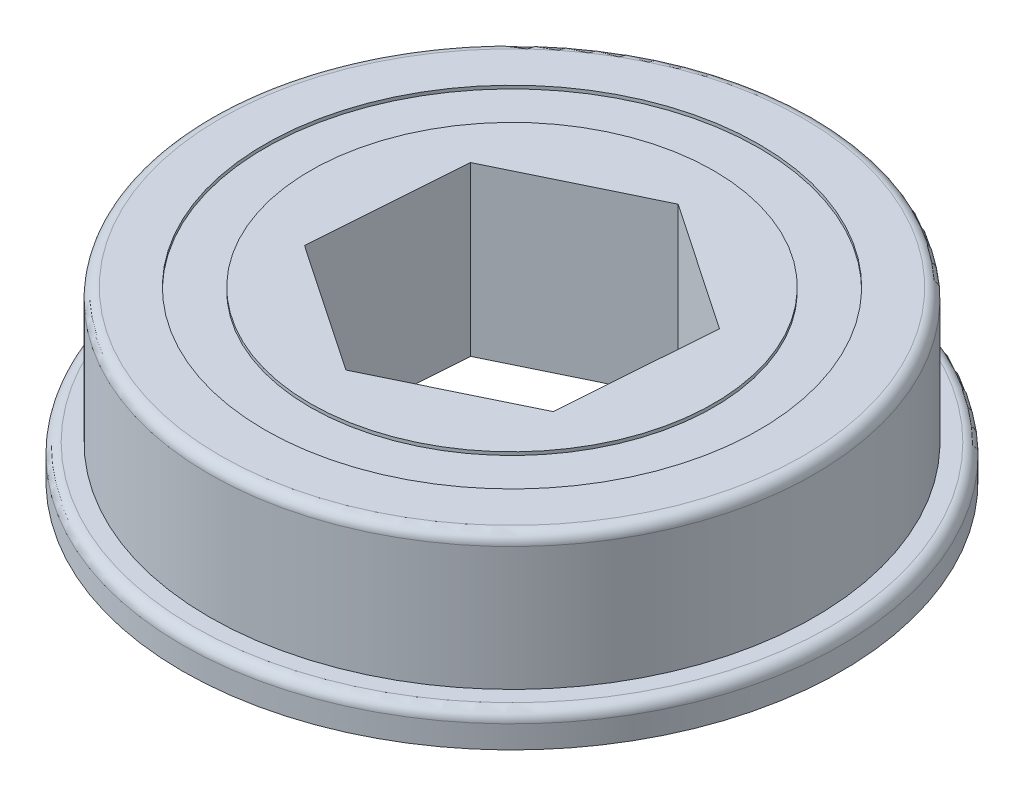
ISO-10303-21;
HEADER;
FILE_DESCRIPTION(('STEP AP214'),'2;1');
FILE_NAME('part.step','',(''),(''),'','','');
FILE_SCHEMA(('AUTOMOTIVE_DESIGN { 1 0 10303 214 1 1 1 1 }'));
ENDSEC;
DATA;
#1=APPLICATION_CONTEXT('core data for automotive mechanical design processes');
#2=APPLICATION_PROTOCOL_DEFINITION('international standard','automotive_design',2000,#1);
#3=PRODUCT_CONTEXT('',#1,'mechanical');
#4=PRODUCT('Part','Part','',(#3));
#5=PRODUCT_RELATED_PRODUCT_CATEGORY('part','',(#4));
#6=PRODUCT_DEFINITION_FORMATION('','',#4);
#7=PRODUCT_DEFINITION_CONTEXT('part definition',#1,'design');
#8=PRODUCT_DEFINITION('design','',#6,#7);
#9=PRODUCT_DEFINITION_SHAPE('','',#8);
#10=(LENGTH_UNIT() NAMED_UNIT(*) SI_UNIT(.MILLI.,.METRE.));
#11=(NAMED_UNIT(*) PLANE_ANGLE_UNIT() SI_UNIT($,.RADIAN.));
#12=(NAMED_UNIT(*) SI_UNIT($,.STERADIAN.) SOLID_ANGLE_UNIT());
#13=UNCERTAINTY_MEASURE_WITH_UNIT(LENGTH_MEASURE(1.E-05),#10,'distance_accuracy_value','');
#14=(GEOMETRIC_REPRESENTATION_CONTEXT(3) GLOBAL_UNCERTAINTY_ASSIGNED_CONTEXT((#13)) GLOBAL_UNIT_ASSIGNED_CONTEXT((#10,
#11,#12)) REPRESENTATION_CONTEXT('',''));
#15=CARTESIAN_POINT('',(0.,0.,0.));
#16=DIRECTION('',(0.,0.,1.));
#17=DIRECTION('',(1.,0.,0.));
#18=AXIS2_PLACEMENT_3D('',#15,#16,#17);
#19=CARTESIAN_POINT('',(0.,7.9248,0.));
#20=DIRECTION('',(0.,-1.,0.));
#21=DIRECTION('',(0.,0.,-1.));
#22=AXIS2_PLACEMENT_3D('',#19,#20,#21);
#23=CYLINDRICAL_SURFACE('',#22,9.525);
#24=CARTESIAN_POINT('',(0.,0.,0.));
#25=DIRECTION('',(0.,1.,0.));
#26=DIRECTION('',(0.,0.,1.));
#27=AXIS2_PLACEMENT_3D('',#24,#25,#26);
#28=CIRCLE('',#27,9.525);
#29=CARTESIAN_POINT('',(0.,0.,9.525));
#30=VERTEX_POINT('',#29);
#31=EDGE_CURVE('E124',#30,#30,#28,.T.);
#32=ORIENTED_EDGE('',*,*,#31,.T.);
#33=EDGE_LOOP('',(#32));
#34=FACE_BOUND('',#33,.T.);
#35=CARTESIAN_POINT('',(0.,0.1524,0.));
#36=DIRECTION('',(0.,1.,0.));
#37=DIRECTION('',(0.,0.,1.));
#38=AXIS2_PLACEMENT_3D('',#35,#36,#37);
#39=CIRCLE('',#38,9.525);
#40=CARTESIAN_POINT('',(0.,0.1524,9.525));
#41=VERTEX_POINT('',#40);
#42=EDGE_CURVE('E183',#41,#41,#39,.T.);
#43=ORIENTED_EDGE('',*,*,#42,.F.);
#44=EDGE_LOOP('',(#43));
#45=FACE_BOUND('',#44,.T.);
#46=ADVANCED_FACE('F40',(#34,#45),#23,.T.);
#47=CARTESIAN_POINT('',(0.,7.9248,0.));
#48=DIRECTION('',(0.,1.,0.));
#49=DIRECTION('',(0.,0.,1.));
#50=AXIS2_PLACEMENT_3D('',#47,#48,#49);
#51=PLANE('',#50);
#52=CARTESIAN_POINT('',(0.,7.9248,0.));
#53=DIRECTION('',(0.,1.,0.));
#54=DIRECTION('',(0.,0.,1.));
#55=AXIS2_PLACEMENT_3D('',#52,#53,#54);
#56=CIRCLE('',#55,9.525);
#57=CARTESIAN_POINT('',(0.,7.9248,9.525));
#58=VERTEX_POINT('',#57);
#59=EDGE_CURVE('E179',#58,#58,#56,.T.);
#60=ORIENTED_EDGE('',*,*,#59,.T.);
#61=EDGE_LOOP('',(#60));
#62=FACE_BOUND('',#61,.T.);
#63=DIRECTION('',(0.0721332531018952,0.,-0.997395003896118));
#64=VECTOR('',#63,1.);
#65=CARTESIAN_POINT('',(6.06900520258137,7.9248,4.11466999701964));
#66=LINE('',#65,#64);
#67=CARTESIAN_POINT('',(6.06900520258137,7.9248,4.11466999701964));
#68=VERTEX_POINT('',#67);
#69=CARTESIAN_POINT('',(6.59791134689933,7.9248,-3.19857768262557));
#70=VERTEX_POINT('',#69);
#71=EDGE_CURVE('E115',#68,#70,#66,.T.);
#72=ORIENTED_EDGE('',*,*,#71,.F.);
#73=DIRECTION('',(0.899836037532666,0.,-0.436228272304205));
#74=VECTOR('',#73,1.);
#75=CARTESIAN_POINT('',(-0.528906144317969,7.9248,7.31324767964521));
#76=LINE('',#75,#74);
#77=CARTESIAN_POINT('',(-0.528906144317969,7.9248,7.31324767964521));
#78=VERTEX_POINT('',#77);
#79=EDGE_CURVE('E106',#78,#68,#76,.T.);
#80=ORIENTED_EDGE('',*,*,#79,.F.);
#81=DIRECTION('',(0.82770278443077,0.,0.561166731591914));
#82=VECTOR('',#81,1.);
#83=CARTESIAN_POINT('',(-6.59791134689933,7.9248,3.19857768262557));
#84=LINE('',#83,#82);
#85=CARTESIAN_POINT('',(-6.59791134689933,7.9248,3.19857768262557));
#86=VERTEX_POINT('',#85);
#87=EDGE_CURVE('E144',#86,#78,#84,.T.);
#88=ORIENTED_EDGE('',*,*,#87,.F.);
#89=DIRECTION('',(-0.0721332531018956,0.,0.997395003896118));
#90=VECTOR('',#89,1.);
#91=CARTESIAN_POINT('',(-6.06900520258137,7.9248,-4.11466999701965));
#92=LINE('',#91,#90);
#93=CARTESIAN_POINT('',(-6.06900520258137,7.9248,-4.11466999701965));
#94=VERTEX_POINT('',#93);
#95=EDGE_CURVE('E141',#94,#86,#92,.T.);
#96=ORIENTED_EDGE('',*,*,#95,.F.);
#97=DIRECTION('',(-0.899836037532666,0.,0.436228272304205));
#98=VECTOR('',#97,1.);
#99=CARTESIAN_POINT('',(0.528906144317966,7.9248,-7.31324767964521));
#100=LINE('',#99,#98);
#101=CARTESIAN_POINT('',(0.528906144317966,7.9248,-7.31324767964521));
#102=VERTEX_POINT('',#101);
#103=EDGE_CURVE('E135',#102,#94,#100,.T.);
#104=ORIENTED_EDGE('',*,*,#103,.F.);
#105=DIRECTION('',(-0.82770278443077,0.,-0.561166731591914));
#106=VECTOR('',#105,1.);
#107=CARTESIAN_POINT('',(6.59791134689933,7.9248,-3.19857768262557));
#108=LINE('',#107,#106);
#109=EDGE_CURVE('E130',#70,#102,#108,.T.);
#110=ORIENTED_EDGE('',*,*,#109,.F.);
#111=EDGE_LOOP('',(#72,#80,#88,#96,#104,#110));
#112=FACE_BOUND('',#111,.T.);
#113=ADVANCED_FACE('F128',(#62,#112),#51,.T.);
#114=CARTESIAN_POINT('',(0.,0.,0.));
#115=DIRECTION('',(0.,1.,0.));
#116=DIRECTION('',(0.,0.,1.));
#117=AXIS2_PLACEMENT_3D('',#114,#115,#116);
#118=PLANE('',#117);
#119=ORIENTED_EDGE('',*,*,#31,.F.);
#120=EDGE_LOOP('',(#119));
#121=FACE_BOUND('',#120,.T.);
#122=DIRECTION('',(0.899836037532666,0.,-0.436228272304205));
#123=VECTOR('',#122,1.);
#124=CARTESIAN_POINT('',(-0.528906144317969,0.,7.31324767964521));
#125=LINE('',#124,#123);
#126=CARTESIAN_POINT('',(-0.528906144317969,0.,7.31324767964521));
#127=VERTEX_POINT('',#126);
#128=CARTESIAN_POINT('',(6.06900520258137,0.,4.11466999701964));
#129=VERTEX_POINT('',#128);
#130=EDGE_CURVE('E69',#127,#129,#125,.T.);
#131=ORIENTED_EDGE('',*,*,#130,.T.);
#132=DIRECTION('',(0.0721332531018952,0.,-0.997395003896118));
#133=VECTOR('',#132,1.);
#134=CARTESIAN_POINT('',(6.06900520258137,0.,4.11466999701964));
#135=LINE('',#134,#133);
#136=CARTESIAN_POINT('',(6.59791134689933,0.,-3.19857768262557));
#137=VERTEX_POINT('',#136);
#138=EDGE_CURVE('E122',#129,#137,#135,.T.);
#139=ORIENTED_EDGE('',*,*,#138,.T.);
#140=DIRECTION('',(-0.82770278443077,0.,-0.561166731591914));
#141=VECTOR('',#140,1.);
#142=CARTESIAN_POINT('',(6.59791134689933,0.,-3.19857768262557));
#143=LINE('',#142,#141);
#144=CARTESIAN_POINT('',(0.528906144317966,0.,-7.31324767964521));
#145=VERTEX_POINT('',#144);
#146=EDGE_CURVE('E152',#137,#145,#143,.T.);
#147=ORIENTED_EDGE('',*,*,#146,.T.);
#148=DIRECTION('',(-0.899836037532666,0.,0.436228272304205));
#149=VECTOR('',#148,1.);
#150=CARTESIAN_POINT('',(0.528906144317966,0.,-7.31324767964521));
#151=LINE('',#150,#149);
#152=CARTESIAN_POINT('',(-6.06900520258137,0.,-4.11466999701965));
#153=VERTEX_POINT('',#152);
#154=EDGE_CURVE('E156',#145,#153,#151,.T.);
#155=ORIENTED_EDGE('',*,*,#154,.T.);
#156=DIRECTION('',(-0.0721332531018956,0.,0.997395003896118));
#157=VECTOR('',#156,1.);
#158=CARTESIAN_POINT('',(-6.06900520258137,0.,-4.11466999701965));
#159=LINE('',#158,#157);
#160=CARTESIAN_POINT('',(-6.59791134689933,0.,3.19857768262557));
#161=VERTEX_POINT('',#160);
#162=EDGE_CURVE('E160',#153,#161,#159,.T.);
#163=ORIENTED_EDGE('',*,*,#162,.T.);
#164=DIRECTION('',(0.82770278443077,0.,0.561166731591914));
#165=VECTOR('',#164,1.);
#166=CARTESIAN_POINT('',(-6.59791134689933,0.,3.19857768262557));
#167=LINE('',#166,#165);
#168=EDGE_CURVE('E116',#161,#127,#167,.T.);
#169=ORIENTED_EDGE('',*,*,#168,.T.);
#170=EDGE_LOOP('',(#131,#139,#147,#155,#163,#169));
#171=FACE_BOUND('',#170,.T.);
#172=ADVANCED_FACE('F220',(#121,#171),#118,.F.);
#173=CARTESIAN_POINT('',(0.,7.7724,0.));
#174=DIRECTION('',(0.,1.,0.));
#175=DIRECTION('',(0.,0.,1.));
#176=AXIS2_PLACEMENT_3D('',#173,#174,#175);
#177=CIRCLE('',#176,9.525);
#178=CARTESIAN_POINT('',(0.,7.7724,9.525));
#179=VERTEX_POINT('',#178);
#180=EDGE_CURVE('E236',#179,#179,#177,.T.);
#181=ORIENTED_EDGE('',*,*,#180,.T.);
#182=EDGE_LOOP('',(#181));
#183=FACE_BOUND('',#182,.T.);
#184=ORIENTED_EDGE('',*,*,#59,.F.);
#185=EDGE_LOOP('',(#184));
#186=FACE_BOUND('',#185,.T.);
#187=ADVANCED_FACE('F216',(#183,#186),#23,.T.);
#188=CARTESIAN_POINT('',(-0.528906144317969,7.9248,7.31324767964521));
#189=DIRECTION('',(-0.436228272304205,0.,-0.899836037532666));
#190=DIRECTION('',(-0.899836037532666,0.,0.436228272304205));
#191=AXIS2_PLACEMENT_3D('',#188,#189,#190);
#192=PLANE('',#191);
#193=ORIENTED_EDGE('',*,*,#130,.F.);
#194=DIRECTION('',(0.,-1.,0.));
#195=VECTOR('',#194,1.);
#196=CARTESIAN_POINT('',(-0.528906144317969,7.9248,7.31324767964521));
#197=LINE('',#196,#195);
#198=EDGE_CURVE('E110',#78,#127,#197,.T.);
#199=ORIENTED_EDGE('',*,*,#198,.F.);
#200=ORIENTED_EDGE('',*,*,#79,.T.);
#201=DIRECTION('',(0.,-1.,0.));
#202=VECTOR('',#201,1.);
#203=CARTESIAN_POINT('',(6.06900520258137,7.9248,4.11466999701964));
#204=LINE('',#203,#202);
#205=EDGE_CURVE('E109',#68,#129,#204,.T.);
#206=ORIENTED_EDGE('',*,*,#205,.T.);
#207=EDGE_LOOP('',(#193,#199,#200,#206));
#208=FACE_BOUND('',#207,.T.);
#209=ADVANCED_FACE('F108',(#208),#192,.T.);
#210=CARTESIAN_POINT('',(6.06900520258137,7.9248,4.11466999701964));
#211=DIRECTION('',(-0.997395003896118,0.,-0.0721332531018952));
#212=DIRECTION('',(-0.0721332531018952,0.,0.997395003896118));
#213=AXIS2_PLACEMENT_3D('',#210,#211,#212);
#214=PLANE('',#213);
#215=ORIENTED_EDGE('',*,*,#138,.F.);
#216=ORIENTED_EDGE('',*,*,#205,.F.);
#217=ORIENTED_EDGE('',*,*,#71,.T.);
#218=DIRECTION('',(0.,-1.,0.));
#219=VECTOR('',#218,1.);
#220=CARTESIAN_POINT('',(6.59791134689933,7.9248,-3.19857768262557));
#221=LINE('',#220,#219);
#222=EDGE_CURVE('E125',#70,#137,#221,.T.);
#223=ORIENTED_EDGE('',*,*,#222,.T.);
#224=EDGE_LOOP('',(#215,#216,#217,#223));
#225=FACE_BOUND('',#224,.T.);
#226=ADVANCED_FACE('F119',(#225),#214,.T.);
#227=CARTESIAN_POINT('',(6.59791134689933,7.9248,-3.19857768262557));
#228=DIRECTION('',(-0.561166731591914,0.,0.82770278443077));
#229=DIRECTION('',(0.82770278443077,0.,0.561166731591914));
#230=AXIS2_PLACEMENT_3D('',#227,#228,#229);
#231=PLANE('',#230);
#232=ORIENTED_EDGE('',*,*,#146,.F.);
#233=ORIENTED_EDGE('',*,*,#222,.F.);
#234=ORIENTED_EDGE('',*,*,#109,.T.);
#235=DIRECTION('',(0.,-1.,0.));
#236=VECTOR('',#235,1.);
#237=CARTESIAN_POINT('',(0.528906144317966,7.9248,-7.31324767964521));
#238=LINE('',#237,#236);
#239=EDGE_CURVE('E174',#102,#145,#238,.T.);
#240=ORIENTED_EDGE('',*,*,#239,.T.);
#241=EDGE_LOOP('',(#232,#233,#234,#240));
#242=FACE_BOUND('',#241,.T.);
#243=ADVANCED_FACE('F308',(#242),#231,.T.);
#244=CARTESIAN_POINT('',(0.528906144317966,7.9248,-7.31324767964521));
#245=DIRECTION('',(0.436228272304205,0.,0.899836037532666));
#246=DIRECTION('',(0.899836037532666,0.,-0.436228272304205));
#247=AXIS2_PLACEMENT_3D('',#244,#245,#246);
#248=PLANE('',#247);
#249=ORIENTED_EDGE('',*,*,#154,.F.);
#250=ORIENTED_EDGE('',*,*,#239,.F.);
#251=ORIENTED_EDGE('',*,*,#103,.T.);
#252=DIRECTION('',(0.,-1.,0.));
#253=VECTOR('',#252,1.);
#254=CARTESIAN_POINT('',(-6.06900520258137,7.9248,-4.11466999701965));
#255=LINE('',#254,#253);
#256=EDGE_CURVE('E171',#94,#153,#255,.T.);
#257=ORIENTED_EDGE('',*,*,#256,.T.);
#258=EDGE_LOOP('',(#249,#250,#251,#257));
#259=FACE_BOUND('',#258,.T.);
#260=ADVANCED_FACE('F304',(#259),#248,.T.);
#261=CARTESIAN_POINT('',(-6.06900520258137,7.9248,-4.11466999701965));
#262=DIRECTION('',(0.997395003896118,0.,0.0721332531018956));
#263=DIRECTION('',(0.0721332531018957,0.,-0.997395003896118));
#264=AXIS2_PLACEMENT_3D('',#261,#262,#263);
#265=PLANE('',#264);
#266=ORIENTED_EDGE('',*,*,#162,.F.);
#267=ORIENTED_EDGE('',*,*,#256,.F.);
#268=ORIENTED_EDGE('',*,*,#95,.T.);
#269=DIRECTION('',(0.,-1.,0.));
#270=VECTOR('',#269,1.);
#271=CARTESIAN_POINT('',(-6.59791134689933,7.9248,3.19857768262557));
#272=LINE('',#271,#270);
#273=EDGE_CURVE('E58',#86,#161,#272,.T.);
#274=ORIENTED_EDGE('',*,*,#273,.T.);
#275=EDGE_LOOP('',(#266,#267,#268,#274));
#276=FACE_BOUND('',#275,.T.);
#277=ADVANCED_FACE('F301',(#276),#265,.T.);
#278=CARTESIAN_POINT('',(-6.59791134689933,7.9248,3.19857768262557));
#279=DIRECTION('',(0.561166731591914,0.,-0.82770278443077));
#280=DIRECTION('',(-0.82770278443077,0.,-0.561166731591914));
#281=AXIS2_PLACEMENT_3D('',#278,#279,#280);
#282=PLANE('',#281);
#283=ORIENTED_EDGE('',*,*,#168,.F.);
#284=ORIENTED_EDGE('',*,*,#273,.F.);
#285=ORIENTED_EDGE('',*,*,#87,.T.);
#286=ORIENTED_EDGE('',*,*,#198,.T.);
#287=EDGE_LOOP('',(#283,#284,#285,#286));
#288=FACE_BOUND('',#287,.T.);
#289=ADVANCED_FACE('F297',(#288),#282,.T.);
#290=CARTESIAN_POINT('',(0.,0.1524,0.));
#291=DIRECTION('',(0.,1.,0.));
#292=DIRECTION('',(0.,0.,1.));
#293=AXIS2_PLACEMENT_3D('',#290,#291,#292);
#294=PLANE('',#293);
#295=ORIENTED_EDGE('',*,*,#42,.T.);
#296=EDGE_LOOP('',(#295));
#297=FACE_BOUND('',#296,.T.);
#298=CARTESIAN_POINT('',(0.,0.1524,0.));
#299=DIRECTION('',(0.,1.,0.));
#300=DIRECTION('',(0.,0.,1.));
#301=AXIS2_PLACEMENT_3D('',#298,#299,#300);
#302=CIRCLE('',#301,11.6745068503196);
#303=CARTESIAN_POINT('',(0.,0.1524,11.6745068503196));
#304=VERTEX_POINT('',#303);
#305=EDGE_CURVE('E149',#304,#304,#302,.T.);
#306=ORIENTED_EDGE('',*,*,#305,.F.);
#307=EDGE_LOOP('',(#306));
#308=FACE_BOUND('',#307,.T.);
#309=ADVANCED_FACE('F293',(#297,#308),#294,.F.);
#310=CARTESIAN_POINT('',(0.,7.7724,0.));
#311=DIRECTION('',(0.,1.,0.));
#312=DIRECTION('',(0.,0.,1.));
#313=AXIS2_PLACEMENT_3D('',#310,#311,#312);
#314=PLANE('',#313);
#315=CARTESIAN_POINT('',(0.,7.7724,0.));
#316=DIRECTION('',(0.,1.,0.));
#317=DIRECTION('',(0.,0.,1.));
#318=AXIS2_PLACEMENT_3D('',#315,#316,#317);
#319=CIRCLE('',#318,11.6745068503196);
#320=CARTESIAN_POINT('',(0.,7.7724,11.6745068503196));
#321=VERTEX_POINT('',#320);
#322=EDGE_CURVE('E240',#321,#321,#319,.F.);
#323=ORIENTED_EDGE('',*,*,#322,.F.);
#324=EDGE_LOOP('',(#323));
#325=FACE_BOUND('',#324,.T.);
#326=ORIENTED_EDGE('',*,*,#180,.F.);
#327=EDGE_LOOP('',(#326));
#328=FACE_BOUND('',#327,.T.);
#329=ADVANCED_FACE('F290',(#325,#328),#314,.T.);
#330=CARTESIAN_POINT('',(0.,7.9248,0.));
#331=DIRECTION('',(0.,-1.,0.));
#332=DIRECTION('',(0.,0.,-1.));
#333=AXIS2_PLACEMENT_3D('',#330,#331,#332);
#334=CYLINDRICAL_SURFACE('',#333,11.6745068503196);
#335=CARTESIAN_POINT('',(0.,0.,0.));
#336=DIRECTION('',(0.,1.,0.));
#337=DIRECTION('',(0.,0.,1.));
#338=AXIS2_PLACEMENT_3D('',#335,#336,#337);
#339=CIRCLE('',#338,11.6745068503196);
#340=CARTESIAN_POINT('',(0.,0.,11.6745068503196));
#341=VERTEX_POINT('',#340);
#342=EDGE_CURVE('E249',#341,#341,#339,.T.);
#343=ORIENTED_EDGE('',*,*,#342,.F.);
#344=EDGE_LOOP('',(#343));
#345=FACE_BOUND('',#344,.T.);
#346=ORIENTED_EDGE('',*,*,#305,.T.);
#347=EDGE_LOOP('',(#346));
#348=FACE_BOUND('',#347,.T.);
#349=ADVANCED_FACE('F279',(#345,#348),#334,.F.);
#350=CARTESIAN_POINT('',(0.,7.9248,0.));
#351=DIRECTION('',(0.,1.,0.));
#352=DIRECTION('',(0.,0.,1.));
#353=AXIS2_PLACEMENT_3D('',#350,#351,#352);
#354=PLANE('',#353);
#355=CARTESIAN_POINT('',(0.,7.9248,0.));
#356=DIRECTION('',(0.,1.,0.));
#357=DIRECTION('',(0.,0.,1.));
#358=AXIS2_PLACEMENT_3D('',#355,#356,#357);
#359=CIRCLE('',#358,13.7795);
#360=CARTESIAN_POINT('',(0.,7.9248,13.7795));
#361=VERTEX_POINT('',#360);
#362=EDGE_CURVE('E49',#361,#361,#359,.T.);
#363=ORIENTED_EDGE('',*,*,#362,.T.);
#364=EDGE_LOOP('',(#363));
#365=FACE_BOUND('',#364,.T.);
#366=CARTESIAN_POINT('',(0.,7.9248,0.));
#367=DIRECTION('',(0.,1.,0.));
#368=DIRECTION('',(0.,0.,1.));
#369=AXIS2_PLACEMENT_3D('',#366,#367,#368);
#370=CIRCLE('',#369,11.6745068503196);
#371=CARTESIAN_POINT('',(0.,7.9248,11.6745068503196));
#372=VERTEX_POINT('',#371);
#373=EDGE_CURVE('E246',#372,#372,#370,.T.);
#374=ORIENTED_EDGE('',*,*,#373,.F.);
#375=EDGE_LOOP('',(#374));
#376=FACE_BOUND('',#375,.T.);
#377=ADVANCED_FACE('F201',(#365,#376),#354,.T.);
#378=CARTESIAN_POINT('',(0.,0.,0.));
#379=DIRECTION('',(0.,1.,0.));
#380=DIRECTION('',(0.,0.,1.));
#381=AXIS2_PLACEMENT_3D('',#378,#379,#380);
#382=PLANE('',#381);
#383=ORIENTED_EDGE('',*,*,#342,.T.);
#384=EDGE_LOOP('',(#383));
#385=FACE_BOUND('',#384,.T.);
#386=CARTESIAN_POINT('',(0.,0.,0.));
#387=DIRECTION('',(0.,1.,0.));
#388=DIRECTION('',(0.,0.,1.));
#389=AXIS2_PLACEMENT_3D('',#386,#387,#388);
#390=CIRCLE('',#389,15.56004);
#391=CARTESIAN_POINT('',(0.,0.,15.56004));
#392=VERTEX_POINT('',#391);
#393=EDGE_CURVE('E253',#392,#392,#390,.T.);
#394=ORIENTED_EDGE('',*,*,#393,.F.);
#395=EDGE_LOOP('',(#394));
#396=FACE_BOUND('',#395,.T.);
#397=ADVANCED_FACE('F283',(#385,#396),#382,.F.);
#398=CARTESIAN_POINT('',(0.,7.9248,0.));
#399=DIRECTION('',(0.,-1.,0.));
#400=DIRECTION('',(0.,0.,-1.));
#401=AXIS2_PLACEMENT_3D('',#398,#399,#400);
#402=CYLINDRICAL_SURFACE('',#401,14.2875);
#403=CARTESIAN_POINT('',(0.,7.4168,0.));
#404=DIRECTION('',(0.,1.,0.));
#405=DIRECTION('',(0.,0.,1.));
#406=AXIS2_PLACEMENT_3D('',#403,#404,#405);
#407=CIRCLE('',#406,14.2875);
#408=CARTESIAN_POINT('',(0.,7.4168,14.2875));
#409=VERTEX_POINT('',#408);
#410=EDGE_CURVE('E11',#409,#409,#407,.F.);
#411=ORIENTED_EDGE('',*,*,#410,.T.);
#412=EDGE_LOOP('',(#411));
#413=FACE_BOUND('',#412,.T.);
#414=CARTESIAN_POINT('',(0.,1.5748,0.));
#415=DIRECTION('',(0.,1.,0.));
#416=DIRECTION('',(0.,0.,1.));
#417=AXIS2_PLACEMENT_3D('',#414,#415,#416);
#418=CIRCLE('',#417,14.2875);
#419=CARTESIAN_POINT('',(0.,1.5748,14.2875));
#420=VERTEX_POINT('',#419);
#421=EDGE_CURVE('E259',#420,#420,#418,.T.);
#422=ORIENTED_EDGE('',*,*,#421,.T.);
#423=EDGE_LOOP('',(#422));
#424=FACE_BOUND('',#423,.T.);
#425=ADVANCED_FACE('F264',(#413,#424),#402,.T.);
#426=ORIENTED_EDGE('',*,*,#322,.T.);
#427=EDGE_LOOP('',(#426));
#428=FACE_BOUND('',#427,.T.);
#429=ORIENTED_EDGE('',*,*,#373,.T.);
#430=EDGE_LOOP('',(#429));
#431=FACE_BOUND('',#430,.T.);
#432=ADVANCED_FACE('F268',(#428,#431),#334,.F.);
#433=CARTESIAN_POINT('',(0.,1.5748,0.));
#434=DIRECTION('',(0.,1.,0.));
#435=DIRECTION('',(0.,0.,1.));
#436=AXIS2_PLACEMENT_3D('',#433,#434,#435);
#437=PLANE('',#436);
#438=CARTESIAN_POINT('',(0.,1.5748,0.));
#439=DIRECTION('',(0.,1.,0.));
#440=DIRECTION('',(0.,0.,1.));
#441=AXIS2_PLACEMENT_3D('',#438,#439,#440);
#442=CIRCLE('',#441,15.05204);
#443=CARTESIAN_POINT('',(0.,1.5748,15.05204));
#444=VERTEX_POINT('',#443);
#445=EDGE_CURVE('E190',#444,#444,#442,.T.);
#446=ORIENTED_EDGE('',*,*,#445,.T.);
#447=EDGE_LOOP('',(#446));
#448=FACE_BOUND('',#447,.T.);
#449=ORIENTED_EDGE('',*,*,#421,.F.);
#450=EDGE_LOOP('',(#449));
#451=FACE_BOUND('',#450,.T.);
#452=ADVANCED_FACE('F266',(#448,#451),#437,.T.);
#453=CARTESIAN_POINT('',(0.,1.5748,0.));
#454=DIRECTION('',(0.,-1.,0.));
#455=DIRECTION('',(0.,0.,-1.));
#456=AXIS2_PLACEMENT_3D('',#453,#454,#455);
#457=CYLINDRICAL_SURFACE('',#456,15.56004);
#458=CARTESIAN_POINT('',(0.,1.0668,0.));
#459=DIRECTION('',(0.,1.,0.));
#460=DIRECTION('',(0.,0.,1.));
#461=AXIS2_PLACEMENT_3D('',#458,#459,#460);
#462=CIRCLE('',#461,15.56004);
#463=CARTESIAN_POINT('',(0.,1.0668,15.56004));
#464=VERTEX_POINT('',#463);
#465=EDGE_CURVE('E194',#464,#464,#462,.F.);
#466=ORIENTED_EDGE('',*,*,#465,.T.);
#467=EDGE_LOOP('',(#466));
#468=FACE_BOUND('',#467,.T.);
#469=ORIENTED_EDGE('',*,*,#393,.T.);
#470=EDGE_LOOP('',(#469));
#471=FACE_BOUND('',#470,.T.);
#472=ADVANCED_FACE('F210',(#468,#471),#457,.T.);
#473=CARTESIAN_POINT('',(0.,1.0668,0.));
#474=DIRECTION('',(0.,1.,0.));
#475=DIRECTION('',(0.,0.,1.));
#476=AXIS2_PLACEMENT_3D('',#473,#474,#475);
#477=TOROIDAL_SURFACE('',#476,15.05204,0.508);
#478=ORIENTED_EDGE('',*,*,#465,.F.);
#479=EDGE_LOOP('',(#478));
#480=FACE_BOUND('',#479,.T.);
#481=ORIENTED_EDGE('',*,*,#445,.F.);
#482=EDGE_LOOP('',(#481));
#483=FACE_BOUND('',#482,.T.);
#484=ADVANCED_FACE('F205',(#480,#483),#477,.T.);
#485=CARTESIAN_POINT('',(0.,7.4168,0.));
#486=DIRECTION('',(0.,1.,0.));
#487=DIRECTION('',(0.,0.,1.));
#488=AXIS2_PLACEMENT_3D('',#485,#486,#487);
#489=TOROIDAL_SURFACE('',#488,13.7795,0.508);
#490=ORIENTED_EDGE('',*,*,#410,.F.);
#491=EDGE_LOOP('',(#490));
#492=FACE_BOUND('',#491,.T.);
#493=ORIENTED_EDGE('',*,*,#362,.F.);
#494=EDGE_LOOP('',(#493));
#495=FACE_BOUND('',#494,.T.);
#496=ADVANCED_FACE('F42',(#492,#495),#489,.T.);
#497=CLOSED_SHELL('',(#46,#113,#172,#187,#209,#226,#243,#260,#277,#289,#309,#329,#349,#377,#397,
#425,#432,#452,#472,#484,#496));
#498=MANIFOLD_SOLID_BREP('B2',#497);
#499=ADVANCED_BREP_SHAPE_REPRESENTATION('',(#18,#498),#14);
#500=SHAPE_DEFINITION_REPRESENTATION(#9,#499);
ENDSEC;
END-ISO-10303-21;
